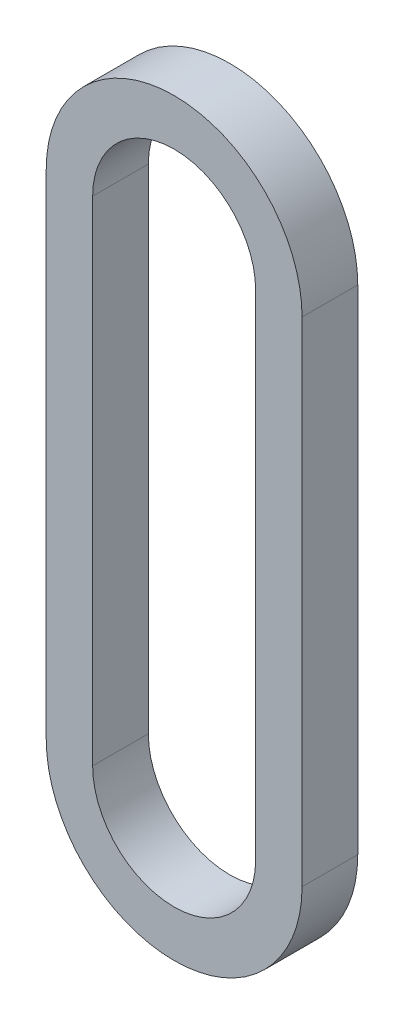
ISO-10303-21;
HEADER;
FILE_DESCRIPTION(('STEP AP214'),'2;1');
FILE_NAME('part.step','',(''),(''),'','','');
FILE_SCHEMA(('AUTOMOTIVE_DESIGN { 1 0 10303 214 1 1 1 1 }'));
ENDSEC;
DATA;
#1=APPLICATION_CONTEXT('core data for automotive mechanical design processes');
#2=APPLICATION_PROTOCOL_DEFINITION('international standard','automotive_design',2000,#1);
#3=PRODUCT_CONTEXT('',#1,'mechanical');
#4=PRODUCT('Part','Part','',(#3));
#5=PRODUCT_RELATED_PRODUCT_CATEGORY('part','',(#4));
#6=PRODUCT_DEFINITION_FORMATION('','',#4);
#7=PRODUCT_DEFINITION_CONTEXT('part definition',#1,'design');
#8=PRODUCT_DEFINITION('design','',#6,#7);
#9=PRODUCT_DEFINITION_SHAPE('','',#8);
#10=(LENGTH_UNIT() NAMED_UNIT(*) SI_UNIT(.MILLI.,.METRE.));
#11=(NAMED_UNIT(*) PLANE_ANGLE_UNIT() SI_UNIT($,.RADIAN.));
#12=(NAMED_UNIT(*) SI_UNIT($,.STERADIAN.) SOLID_ANGLE_UNIT());
#13=UNCERTAINTY_MEASURE_WITH_UNIT(LENGTH_MEASURE(1.E-05),#10,'distance_accuracy_value','');
#14=(GEOMETRIC_REPRESENTATION_CONTEXT(3) GLOBAL_UNCERTAINTY_ASSIGNED_CONTEXT((#13)) GLOBAL_UNIT_ASSIGNED_CONTEXT((#10,
#11,#12)) REPRESENTATION_CONTEXT('',''));
#15=CARTESIAN_POINT('',(0.,0.,0.));
#16=DIRECTION('',(0.,0.,1.));
#17=DIRECTION('',(1.,0.,0.));
#18=AXIS2_PLACEMENT_3D('',#15,#16,#17);
#19=CARTESIAN_POINT('',(0.,0.,7.62));
#20=DIRECTION('',(0.,0.,1.));
#21=DIRECTION('',(1.,0.,0.));
#22=AXIS2_PLACEMENT_3D('',#19,#20,#21);
#23=PLANE('',#22);
#24=CARTESIAN_POINT('',(0.,0.,7.62));
#25=DIRECTION('',(0.,0.,1.));
#26=DIRECTION('',(1.,0.,0.));
#27=AXIS2_PLACEMENT_3D('',#24,#25,#26);
#28=CIRCLE('',#27,17.5006);
#29=CARTESIAN_POINT('',(-17.5006,0.,7.62));
#30=VERTEX_POINT('',#29);
#31=CARTESIAN_POINT('',(17.5006,0.,7.62));
#32=VERTEX_POINT('',#31);
#33=EDGE_CURVE('E159',#30,#32,#28,.T.);
#34=ORIENTED_EDGE('',*,*,#33,.T.);
#35=DIRECTION('',(0.,1.,0.));
#36=VECTOR('',#35,1.);
#37=CARTESIAN_POINT('',(17.5006,0.,7.62));
#38=LINE('',#37,#36);
#39=CARTESIAN_POINT('',(17.5006,67.5,7.62));
#40=VERTEX_POINT('',#39);
#41=EDGE_CURVE('E163',#32,#40,#38,.T.);
#42=ORIENTED_EDGE('',*,*,#41,.T.);
#43=CARTESIAN_POINT('',(0.,67.5,7.62));
#44=DIRECTION('',(0.,0.,1.));
#45=DIRECTION('',(1.,0.,0.));
#46=AXIS2_PLACEMENT_3D('',#43,#44,#45);
#47=CIRCLE('',#46,17.5006);
#48=CARTESIAN_POINT('',(-17.5006,67.5,7.62));
#49=VERTEX_POINT('',#48);
#50=EDGE_CURVE('E167',#40,#49,#47,.T.);
#51=ORIENTED_EDGE('',*,*,#50,.T.);
#52=DIRECTION('',(0.,-1.,0.));
#53=VECTOR('',#52,1.);
#54=CARTESIAN_POINT('',(-17.5006,0.,7.62));
#55=LINE('',#54,#53);
#56=EDGE_CURVE('E170',#49,#30,#55,.T.);
#57=ORIENTED_EDGE('',*,*,#56,.T.);
#58=EDGE_LOOP('',(#34,#42,#51,#57));
#59=FACE_BOUND('',#58,.T.);
#60=DIRECTION('',(0.,1.,0.));
#61=VECTOR('',#60,1.);
#62=CARTESIAN_POINT('',(11.1506,0.,7.62));
#63=LINE('',#62,#61);
#64=CARTESIAN_POINT('',(11.1506,0.,7.62));
#65=VERTEX_POINT('',#64);
#66=CARTESIAN_POINT('',(11.1506,67.5,7.62));
#67=VERTEX_POINT('',#66);
#68=EDGE_CURVE('E120',#65,#67,#63,.T.);
#69=ORIENTED_EDGE('',*,*,#68,.F.);
#70=CARTESIAN_POINT('',(0.,0.,7.62));
#71=DIRECTION('',(0.,0.,1.));
#72=DIRECTION('',(1.,0.,0.));
#73=AXIS2_PLACEMENT_3D('',#70,#71,#72);
#74=CIRCLE('',#73,11.1506);
#75=CARTESIAN_POINT('',(-11.1506,0.,7.62));
#76=VERTEX_POINT('',#75);
#77=EDGE_CURVE('E111',#76,#65,#74,.T.);
#78=ORIENTED_EDGE('',*,*,#77,.F.);
#79=DIRECTION('',(0.,-1.,0.));
#80=VECTOR('',#79,1.);
#81=CARTESIAN_POINT('',(-11.1506,0.,7.62));
#82=LINE('',#81,#80);
#83=CARTESIAN_POINT('',(-11.1506,67.5,7.62));
#84=VERTEX_POINT('',#83);
#85=EDGE_CURVE('E137',#84,#76,#82,.T.);
#86=ORIENTED_EDGE('',*,*,#85,.F.);
#87=CARTESIAN_POINT('',(0.,67.5,7.62));
#88=DIRECTION('',(0.,0.,1.));
#89=DIRECTION('',(1.,0.,0.));
#90=AXIS2_PLACEMENT_3D('',#87,#88,#89);
#91=CIRCLE('',#90,11.1506);
#92=EDGE_CURVE('E133',#67,#84,#91,.T.);
#93=ORIENTED_EDGE('',*,*,#92,.F.);
#94=EDGE_LOOP('',(#69,#78,#86,#93));
#95=FACE_BOUND('',#94,.T.);
#96=ADVANCED_FACE('F45',(#59,#95),#23,.T.);
#97=CARTESIAN_POINT('',(0.,0.,0.));
#98=DIRECTION('',(0.,0.,1.));
#99=DIRECTION('',(1.,0.,0.));
#100=AXIS2_PLACEMENT_3D('',#97,#98,#99);
#101=PLANE('',#100);
#102=CARTESIAN_POINT('',(0.,0.,0.));
#103=DIRECTION('',(0.,0.,1.));
#104=DIRECTION('',(1.,0.,0.));
#105=AXIS2_PLACEMENT_3D('',#102,#103,#104);
#106=CIRCLE('',#105,17.5006);
#107=CARTESIAN_POINT('',(-17.5006,0.,0.));
#108=VERTEX_POINT('',#107);
#109=CARTESIAN_POINT('',(17.5006,0.,0.));
#110=VERTEX_POINT('',#109);
#111=EDGE_CURVE('E129',#108,#110,#106,.T.);
#112=ORIENTED_EDGE('',*,*,#111,.F.);
#113=DIRECTION('',(0.,-1.,0.));
#114=VECTOR('',#113,1.);
#115=CARTESIAN_POINT('',(-17.5006,0.,0.));
#116=LINE('',#115,#114);
#117=CARTESIAN_POINT('',(-17.5006,67.5,0.));
#118=VERTEX_POINT('',#117);
#119=EDGE_CURVE('E164',#118,#108,#116,.T.);
#120=ORIENTED_EDGE('',*,*,#119,.F.);
#121=CARTESIAN_POINT('',(0.,67.5,0.));
#122=DIRECTION('',(0.,0.,1.));
#123=DIRECTION('',(1.,0.,0.));
#124=AXIS2_PLACEMENT_3D('',#121,#122,#123);
#125=CIRCLE('',#124,17.5006);
#126=CARTESIAN_POINT('',(17.5006,67.5,0.));
#127=VERTEX_POINT('',#126);
#128=EDGE_CURVE('E180',#127,#118,#125,.T.);
#129=ORIENTED_EDGE('',*,*,#128,.F.);
#130=DIRECTION('',(0.,1.,0.));
#131=VECTOR('',#130,1.);
#132=CARTESIAN_POINT('',(17.5006,0.,0.));
#133=LINE('',#132,#131);
#134=EDGE_CURVE('E177',#110,#127,#133,.T.);
#135=ORIENTED_EDGE('',*,*,#134,.F.);
#136=EDGE_LOOP('',(#112,#120,#129,#135));
#137=FACE_BOUND('',#136,.T.);
#138=CARTESIAN_POINT('',(0.,0.,0.));
#139=DIRECTION('',(0.,0.,1.));
#140=DIRECTION('',(1.,0.,0.));
#141=AXIS2_PLACEMENT_3D('',#138,#139,#140);
#142=CIRCLE('',#141,11.1506);
#143=CARTESIAN_POINT('',(-11.1506,0.,0.));
#144=VERTEX_POINT('',#143);
#145=CARTESIAN_POINT('',(11.1506,0.,0.));
#146=VERTEX_POINT('',#145);
#147=EDGE_CURVE('E69',#144,#146,#142,.T.);
#148=ORIENTED_EDGE('',*,*,#147,.T.);
#149=DIRECTION('',(0.,1.,0.));
#150=VECTOR('',#149,1.);
#151=CARTESIAN_POINT('',(11.1506,0.,0.));
#152=LINE('',#151,#150);
#153=CARTESIAN_POINT('',(11.1506,67.5,0.));
#154=VERTEX_POINT('',#153);
#155=EDGE_CURVE('E127',#146,#154,#152,.T.);
#156=ORIENTED_EDGE('',*,*,#155,.T.);
#157=CARTESIAN_POINT('',(0.,67.5,0.));
#158=DIRECTION('',(0.,0.,1.));
#159=DIRECTION('',(1.,0.,0.));
#160=AXIS2_PLACEMENT_3D('',#157,#158,#159);
#161=CIRCLE('',#160,11.1506);
#162=CARTESIAN_POINT('',(-11.1506,67.5,0.));
#163=VERTEX_POINT('',#162);
#164=EDGE_CURVE('E146',#154,#163,#161,.T.);
#165=ORIENTED_EDGE('',*,*,#164,.T.);
#166=DIRECTION('',(0.,-1.,0.));
#167=VECTOR('',#166,1.);
#168=CARTESIAN_POINT('',(-11.1506,0.,0.));
#169=LINE('',#168,#167);
#170=EDGE_CURVE('E121',#163,#144,#169,.T.);
#171=ORIENTED_EDGE('',*,*,#170,.T.);
#172=EDGE_LOOP('',(#148,#156,#165,#171));
#173=FACE_BOUND('',#172,.T.);
#174=ADVANCED_FACE('F203',(#137,#173),#101,.F.);
#175=CARTESIAN_POINT('',(0.,0.,7.62));
#176=DIRECTION('',(0.,0.,-1.));
#177=DIRECTION('',(-1.,0.,0.));
#178=AXIS2_PLACEMENT_3D('',#175,#176,#177);
#179=CYLINDRICAL_SURFACE('',#178,17.5006);
#180=ORIENTED_EDGE('',*,*,#111,.T.);
#181=DIRECTION('',(0.,0.,-1.));
#182=VECTOR('',#181,1.);
#183=CARTESIAN_POINT('',(17.5006,0.,7.62));
#184=LINE('',#183,#182);
#185=EDGE_CURVE('E11',#32,#110,#184,.T.);
#186=ORIENTED_EDGE('',*,*,#185,.F.);
#187=ORIENTED_EDGE('',*,*,#33,.F.);
#188=DIRECTION('',(0.,0.,-1.));
#189=VECTOR('',#188,1.);
#190=CARTESIAN_POINT('',(-17.5006,0.,7.62));
#191=LINE('',#190,#189);
#192=EDGE_CURVE('E173',#30,#108,#191,.T.);
#193=ORIENTED_EDGE('',*,*,#192,.T.);
#194=EDGE_LOOP('',(#180,#186,#187,#193));
#195=FACE_BOUND('',#194,.T.);
#196=ADVANCED_FACE('F47',(#195),#179,.T.);
#197=CARTESIAN_POINT('',(17.5006,0.,7.62));
#198=DIRECTION('',(-1.,0.,0.));
#199=DIRECTION('',(0.,0.,1.));
#200=AXIS2_PLACEMENT_3D('',#197,#198,#199);
#201=PLANE('',#200);
#202=ORIENTED_EDGE('',*,*,#134,.T.);
#203=DIRECTION('',(0.,0.,-1.));
#204=VECTOR('',#203,1.);
#205=CARTESIAN_POINT('',(17.5006,67.5,7.62));
#206=LINE('',#205,#204);
#207=EDGE_CURVE('E54',#40,#127,#206,.T.);
#208=ORIENTED_EDGE('',*,*,#207,.F.);
#209=ORIENTED_EDGE('',*,*,#41,.F.);
#210=ORIENTED_EDGE('',*,*,#185,.T.);
#211=EDGE_LOOP('',(#202,#208,#209,#210));
#212=FACE_BOUND('',#211,.T.);
#213=ADVANCED_FACE('F213',(#212),#201,.F.);
#214=CARTESIAN_POINT('',(0.,67.5,7.62));
#215=DIRECTION('',(0.,0.,-1.));
#216=DIRECTION('',(-1.,0.,0.));
#217=AXIS2_PLACEMENT_3D('',#214,#215,#216);
#218=CYLINDRICAL_SURFACE('',#217,17.5006);
#219=ORIENTED_EDGE('',*,*,#128,.T.);
#220=DIRECTION('',(0.,0.,-1.));
#221=VECTOR('',#220,1.);
#222=CARTESIAN_POINT('',(-17.5006,67.5,7.62));
#223=LINE('',#222,#221);
#224=EDGE_CURVE('E188',#49,#118,#223,.T.);
#225=ORIENTED_EDGE('',*,*,#224,.F.);
#226=ORIENTED_EDGE('',*,*,#50,.F.);
#227=ORIENTED_EDGE('',*,*,#207,.T.);
#228=EDGE_LOOP('',(#219,#225,#226,#227));
#229=FACE_BOUND('',#228,.T.);
#230=ADVANCED_FACE('F197',(#229),#218,.T.);
#231=CARTESIAN_POINT('',(-17.5006,0.,7.62));
#232=DIRECTION('',(1.,0.,0.));
#233=DIRECTION('',(0.,0.,-1.));
#234=AXIS2_PLACEMENT_3D('',#231,#232,#233);
#235=PLANE('',#234);
#236=ORIENTED_EDGE('',*,*,#119,.T.);
#237=ORIENTED_EDGE('',*,*,#192,.F.);
#238=ORIENTED_EDGE('',*,*,#56,.F.);
#239=ORIENTED_EDGE('',*,*,#224,.T.);
#240=EDGE_LOOP('',(#236,#237,#238,#239));
#241=FACE_BOUND('',#240,.T.);
#242=ADVANCED_FACE('F207',(#241),#235,.F.);
#243=CARTESIAN_POINT('',(0.,0.,7.62));
#244=DIRECTION('',(0.,0.,-1.));
#245=DIRECTION('',(-1.,0.,0.));
#246=AXIS2_PLACEMENT_3D('',#243,#244,#245);
#247=CYLINDRICAL_SURFACE('',#246,11.1506);
#248=ORIENTED_EDGE('',*,*,#147,.F.);
#249=DIRECTION('',(0.,0.,-1.));
#250=VECTOR('',#249,1.);
#251=CARTESIAN_POINT('',(-11.1506,0.,7.62));
#252=LINE('',#251,#250);
#253=EDGE_CURVE('E115',#76,#144,#252,.T.);
#254=ORIENTED_EDGE('',*,*,#253,.F.);
#255=ORIENTED_EDGE('',*,*,#77,.T.);
#256=DIRECTION('',(0.,0.,-1.));
#257=VECTOR('',#256,1.);
#258=CARTESIAN_POINT('',(11.1506,0.,7.62));
#259=LINE('',#258,#257);
#260=EDGE_CURVE('E114',#65,#146,#259,.T.);
#261=ORIENTED_EDGE('',*,*,#260,.T.);
#262=EDGE_LOOP('',(#248,#254,#255,#261));
#263=FACE_BOUND('',#262,.T.);
#264=ADVANCED_FACE('F113',(#263),#247,.F.);
#265=CARTESIAN_POINT('',(11.1506,0.,7.62));
#266=DIRECTION('',(-1.,0.,0.));
#267=DIRECTION('',(0.,0.,1.));
#268=AXIS2_PLACEMENT_3D('',#265,#266,#267);
#269=PLANE('',#268);
#270=ORIENTED_EDGE('',*,*,#155,.F.);
#271=ORIENTED_EDGE('',*,*,#260,.F.);
#272=ORIENTED_EDGE('',*,*,#68,.T.);
#273=DIRECTION('',(0.,0.,-1.));
#274=VECTOR('',#273,1.);
#275=CARTESIAN_POINT('',(11.1506,67.5,7.62));
#276=LINE('',#275,#274);
#277=EDGE_CURVE('E130',#67,#154,#276,.T.);
#278=ORIENTED_EDGE('',*,*,#277,.T.);
#279=EDGE_LOOP('',(#270,#271,#272,#278));
#280=FACE_BOUND('',#279,.T.);
#281=ADVANCED_FACE('F124',(#280),#269,.T.);
#282=CARTESIAN_POINT('',(0.,67.5,7.62));
#283=DIRECTION('',(0.,0.,-1.));
#284=DIRECTION('',(-1.,0.,0.));
#285=AXIS2_PLACEMENT_3D('',#282,#283,#284);
#286=CYLINDRICAL_SURFACE('',#285,11.1506);
#287=ORIENTED_EDGE('',*,*,#164,.F.);
#288=ORIENTED_EDGE('',*,*,#277,.F.);
#289=ORIENTED_EDGE('',*,*,#92,.T.);
#290=DIRECTION('',(0.,0.,-1.));
#291=VECTOR('',#290,1.);
#292=CARTESIAN_POINT('',(-11.1506,67.5,7.62));
#293=LINE('',#292,#291);
#294=EDGE_CURVE('E61',#84,#163,#293,.T.);
#295=ORIENTED_EDGE('',*,*,#294,.T.);
#296=EDGE_LOOP('',(#287,#288,#289,#295));
#297=FACE_BOUND('',#296,.T.);
#298=ADVANCED_FACE('F236',(#297),#286,.F.);
#299=CARTESIAN_POINT('',(-11.1506,0.,7.62));
#300=DIRECTION('',(1.,0.,0.));
#301=DIRECTION('',(0.,0.,-1.));
#302=AXIS2_PLACEMENT_3D('',#299,#300,#301);
#303=PLANE('',#302);
#304=ORIENTED_EDGE('',*,*,#170,.F.);
#305=ORIENTED_EDGE('',*,*,#294,.F.);
#306=ORIENTED_EDGE('',*,*,#85,.T.);
#307=ORIENTED_EDGE('',*,*,#253,.T.);
#308=EDGE_LOOP('',(#304,#305,#306,#307));
#309=FACE_BOUND('',#308,.T.);
#310=ADVANCED_FACE('F240',(#309),#303,.T.);
#311=CLOSED_SHELL('',(#96,#174,#196,#213,#230,#242,#264,#281,#298,#310));
#312=MANIFOLD_SOLID_BREP('B2',#311);
#313=ADVANCED_BREP_SHAPE_REPRESENTATION('',(#18,#312),#14);
#314=SHAPE_DEFINITION_REPRESENTATION(#9,#313);
ENDSEC;
END-ISO-10303-21;
